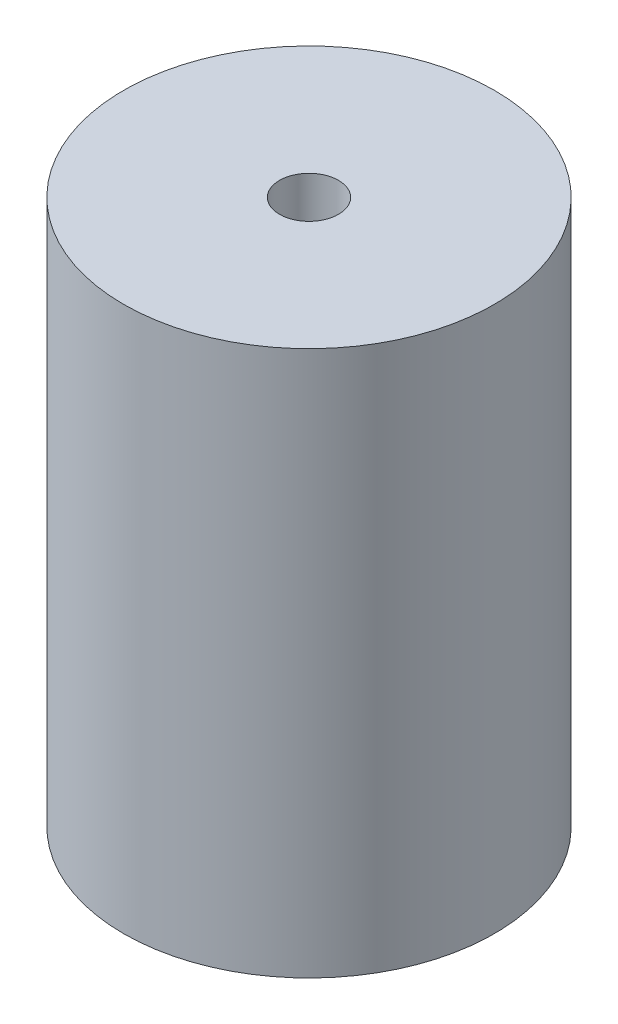
ISO-10303-21;
HEADER;
FILE_DESCRIPTION(('STEP AP214'),'2;1');
FILE_NAME('part.step','',(''),(''),'','','');
FILE_SCHEMA(('AUTOMOTIVE_DESIGN { 1 0 10303 214 1 1 1 1 }'));
ENDSEC;
DATA;
#1=APPLICATION_CONTEXT('core data for automotive mechanical design processes');
#2=APPLICATION_PROTOCOL_DEFINITION('international standard','automotive_design',2000,#1);
#3=PRODUCT_CONTEXT('',#1,'mechanical');
#4=PRODUCT('Part','Part','',(#3));
#5=PRODUCT_RELATED_PRODUCT_CATEGORY('part','',(#4));
#6=PRODUCT_DEFINITION_FORMATION('','',#4);
#7=PRODUCT_DEFINITION_CONTEXT('part definition',#1,'design');
#8=PRODUCT_DEFINITION('design','',#6,#7);
#9=PRODUCT_DEFINITION_SHAPE('','',#8);
#10=(LENGTH_UNIT() NAMED_UNIT(*) SI_UNIT(.MILLI.,.METRE.));
#11=(NAMED_UNIT(*) PLANE_ANGLE_UNIT() SI_UNIT($,.RADIAN.));
#12=(NAMED_UNIT(*) SI_UNIT($,.STERADIAN.) SOLID_ANGLE_UNIT());
#13=UNCERTAINTY_MEASURE_WITH_UNIT(LENGTH_MEASURE(1.E-05),#10,'distance_accuracy_value','');
#14=(GEOMETRIC_REPRESENTATION_CONTEXT(3) GLOBAL_UNCERTAINTY_ASSIGNED_CONTEXT((#13)) GLOBAL_UNIT_ASSIGNED_CONTEXT((#10,
#11,#12)) REPRESENTATION_CONTEXT('',''));
#15=CARTESIAN_POINT('',(0.,0.,0.));
#16=DIRECTION('',(0.,0.,1.));
#17=DIRECTION('',(1.,0.,0.));
#18=AXIS2_PLACEMENT_3D('',#15,#16,#17);
#19=CARTESIAN_POINT('',(0.,18.669,0.));
#20=DIRECTION('',(0.,-1.,0.));
#21=DIRECTION('',(0.,0.,-1.));
#22=AXIS2_PLACEMENT_3D('',#19,#20,#21);
#23=CYLINDRICAL_SURFACE('',#22,12.7);
#24=CARTESIAN_POINT('',(0.,18.669,0.));
#25=DIRECTION('',(0.,1.,0.));
#26=DIRECTION('',(0.,0.,1.));
#27=AXIS2_PLACEMENT_3D('',#24,#25,#26);
#28=CIRCLE('',#27,12.7);
#29=CARTESIAN_POINT('',(0.,18.669,12.7));
#30=VERTEX_POINT('',#29);
#31=EDGE_CURVE('E10',#30,#30,#28,.T.);
#32=ORIENTED_EDGE('',*,*,#31,.F.);
#33=EDGE_LOOP('',(#32));
#34=FACE_BOUND('',#33,.T.);
#35=CARTESIAN_POINT('',(0.,-18.669,0.));
#36=DIRECTION('',(0.,1.,0.));
#37=DIRECTION('',(0.,0.,1.));
#38=AXIS2_PLACEMENT_3D('',#35,#36,#37);
#39=CIRCLE('',#38,12.7);
#40=CARTESIAN_POINT('',(0.,-18.669,12.7));
#41=VERTEX_POINT('',#40);
#42=EDGE_CURVE('E36',#41,#41,#39,.T.);
#43=ORIENTED_EDGE('',*,*,#42,.T.);
#44=EDGE_LOOP('',(#43));
#45=FACE_BOUND('',#44,.T.);
#46=ADVANCED_FACE('F33',(#34,#45),#23,.T.);
#47=CARTESIAN_POINT('',(0.,18.669,0.));
#48=DIRECTION('',(0.,1.,0.));
#49=DIRECTION('',(0.,0.,1.));
#50=AXIS2_PLACEMENT_3D('',#47,#48,#49);
#51=PLANE('',#50);
#52=CARTESIAN_POINT('',(0.,18.669,0.));
#53=DIRECTION('',(0.,1.,0.));
#54=DIRECTION('',(0.,0.,1.));
#55=AXIS2_PLACEMENT_3D('',#52,#53,#54);
#56=CIRCLE('',#55,2.01929999999999);
#57=CARTESIAN_POINT('',(0.,18.669,2.01929999999999));
#58=VERTEX_POINT('',#57);
#59=EDGE_CURVE('E47',#58,#58,#56,.T.);
#60=ORIENTED_EDGE('',*,*,#59,.F.);
#61=EDGE_LOOP('',(#60));
#62=FACE_BOUND('',#61,.T.);
#63=ORIENTED_EDGE('',*,*,#31,.T.);
#64=EDGE_LOOP('',(#63));
#65=FACE_BOUND('',#64,.T.);
#66=ADVANCED_FACE('F53',(#62,#65),#51,.T.);
#67=CARTESIAN_POINT('',(0.,-18.669,0.));
#68=DIRECTION('',(0.,1.,0.));
#69=DIRECTION('',(0.,0.,1.));
#70=AXIS2_PLACEMENT_3D('',#67,#68,#69);
#71=PLANE('',#70);
#72=CARTESIAN_POINT('',(0.,-18.669,0.));
#73=DIRECTION('',(0.,1.,0.));
#74=DIRECTION('',(0.,0.,1.));
#75=AXIS2_PLACEMENT_3D('',#72,#73,#74);
#76=CIRCLE('',#75,2.01929999999999);
#77=CARTESIAN_POINT('',(0.,-18.669,2.01929999999999));
#78=VERTEX_POINT('',#77);
#79=EDGE_CURVE('E43',#78,#78,#76,.T.);
#80=ORIENTED_EDGE('',*,*,#79,.T.);
#81=EDGE_LOOP('',(#80));
#82=FACE_BOUND('',#81,.T.);
#83=ORIENTED_EDGE('',*,*,#42,.F.);
#84=EDGE_LOOP('',(#83));
#85=FACE_BOUND('',#84,.T.);
#86=ADVANCED_FACE('F55',(#82,#85),#71,.F.);
#87=CARTESIAN_POINT('',(0.,18.669,0.));
#88=DIRECTION('',(0.,1.,0.));
#89=DIRECTION('',(0.,0.,1.));
#90=AXIS2_PLACEMENT_3D('',#87,#88,#89);
#91=CYLINDRICAL_SURFACE('',#90,2.01929999999999);
#92=ORIENTED_EDGE('',*,*,#79,.F.);
#93=EDGE_LOOP('',(#92));
#94=FACE_BOUND('',#93,.T.);
#95=ORIENTED_EDGE('',*,*,#59,.T.);
#96=EDGE_LOOP('',(#95));
#97=FACE_BOUND('',#96,.T.);
#98=ADVANCED_FACE('F51',(#94,#97),#91,.F.);
#99=CLOSED_SHELL('',(#46,#66,#86,#98));
#100=MANIFOLD_SOLID_BREP('B2',#99);
#101=ADVANCED_BREP_SHAPE_REPRESENTATION('',(#18,#100),#14);
#102=SHAPE_DEFINITION_REPRESENTATION(#9,#101);
ENDSEC;
END-ISO-10303-21;
